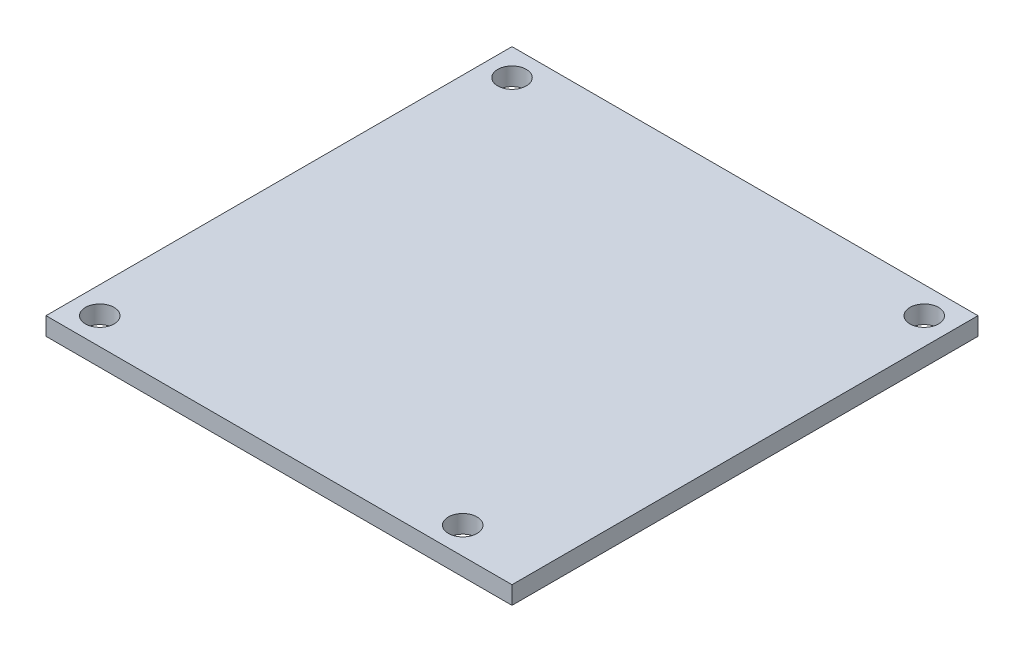
ISO-10303-21;
HEADER;
FILE_DESCRIPTION(('STEP AP214'),'2;1');
FILE_NAME('part.step','',(''),(''),'','','');
FILE_SCHEMA(('AUTOMOTIVE_DESIGN { 1 0 10303 214 1 1 1 1 }'));
ENDSEC;
DATA;
#1=APPLICATION_CONTEXT('core data for automotive mechanical design processes');
#2=APPLICATION_PROTOCOL_DEFINITION('international standard','automotive_design',2000,#1);
#3=PRODUCT_CONTEXT('',#1,'mechanical');
#4=PRODUCT('Part','Part','',(#3));
#5=PRODUCT_RELATED_PRODUCT_CATEGORY('part','',(#4));
#6=PRODUCT_DEFINITION_FORMATION('','',#4);
#7=PRODUCT_DEFINITION_CONTEXT('part definition',#1,'design');
#8=PRODUCT_DEFINITION('design','',#6,#7);
#9=PRODUCT_DEFINITION_SHAPE('','',#8);
#10=(LENGTH_UNIT() NAMED_UNIT(*) SI_UNIT(.MILLI.,.METRE.));
#11=(NAMED_UNIT(*) PLANE_ANGLE_UNIT() SI_UNIT($,.RADIAN.));
#12=(NAMED_UNIT(*) SI_UNIT($,.STERADIAN.) SOLID_ANGLE_UNIT());
#13=UNCERTAINTY_MEASURE_WITH_UNIT(LENGTH_MEASURE(1.E-05),#10,'distance_accuracy_value','');
#14=(GEOMETRIC_REPRESENTATION_CONTEXT(3) GLOBAL_UNCERTAINTY_ASSIGNED_CONTEXT((#13)) GLOBAL_UNIT_ASSIGNED_CONTEXT((#10,
#11,#12)) REPRESENTATION_CONTEXT('',''));
#15=CARTESIAN_POINT('',(0.,0.,0.));
#16=DIRECTION('',(0.,0.,1.));
#17=DIRECTION('',(1.,0.,0.));
#18=AXIS2_PLACEMENT_3D('',#15,#16,#17);
#19=CARTESIAN_POINT('',(26.,2.,-26.));
#20=DIRECTION('',(-1.,0.,0.));
#21=DIRECTION('',(0.,0.,1.));
#22=AXIS2_PLACEMENT_3D('',#19,#20,#21);
#23=PLANE('',#22);
#24=DIRECTION('',(0.,0.,-1.));
#25=VECTOR('',#24,1.);
#26=CARTESIAN_POINT('',(26.,0.,-26.));
#27=LINE('',#26,#25);
#28=CARTESIAN_POINT('',(26.,0.,26.));
#29=VERTEX_POINT('',#28);
#30=CARTESIAN_POINT('',(26.,0.,-26.));
#31=VERTEX_POINT('',#30);
#32=EDGE_CURVE('E98',#29,#31,#27,.T.);
#33=ORIENTED_EDGE('',*,*,#32,.T.);
#34=DIRECTION('',(0.,-1.,0.));
#35=VECTOR('',#34,1.);
#36=CARTESIAN_POINT('',(26.,2.,-26.));
#37=LINE('',#36,#35);
#38=CARTESIAN_POINT('',(26.,2.,-26.));
#39=VERTEX_POINT('',#38);
#40=EDGE_CURVE('E11',#39,#31,#37,.T.);
#41=ORIENTED_EDGE('',*,*,#40,.F.);
#42=DIRECTION('',(0.,0.,-1.));
#43=VECTOR('',#42,1.);
#44=CARTESIAN_POINT('',(26.,2.,-26.));
#45=LINE('',#44,#43);
#46=CARTESIAN_POINT('',(26.,2.,26.));
#47=VERTEX_POINT('',#46);
#48=EDGE_CURVE('E86',#47,#39,#45,.T.);
#49=ORIENTED_EDGE('',*,*,#48,.F.);
#50=DIRECTION('',(0.,-1.,0.));
#51=VECTOR('',#50,1.);
#52=CARTESIAN_POINT('',(26.,2.,26.));
#53=LINE('',#52,#51);
#54=EDGE_CURVE('E94',#47,#29,#53,.T.);
#55=ORIENTED_EDGE('',*,*,#54,.T.);
#56=EDGE_LOOP('',(#33,#41,#49,#55));
#57=FACE_BOUND('',#56,.T.);
#58=ADVANCED_FACE('F35',(#57),#23,.F.);
#59=CARTESIAN_POINT('',(-26.,2.,-26.));
#60=DIRECTION('',(0.,0.,1.));
#61=DIRECTION('',(1.,0.,0.));
#62=AXIS2_PLACEMENT_3D('',#59,#60,#61);
#63=PLANE('',#62);
#64=DIRECTION('',(-1.,0.,0.));
#65=VECTOR('',#64,1.);
#66=CARTESIAN_POINT('',(-26.,0.,-26.));
#67=LINE('',#66,#65);
#68=CARTESIAN_POINT('',(-26.,0.,-26.));
#69=VERTEX_POINT('',#68);
#70=EDGE_CURVE('E90',#31,#69,#67,.T.);
#71=ORIENTED_EDGE('',*,*,#70,.T.);
#72=DIRECTION('',(0.,-1.,0.));
#73=VECTOR('',#72,1.);
#74=CARTESIAN_POINT('',(-26.,2.,-26.));
#75=LINE('',#74,#73);
#76=CARTESIAN_POINT('',(-26.,2.,-26.));
#77=VERTEX_POINT('',#76);
#78=EDGE_CURVE('E43',#77,#69,#75,.T.);
#79=ORIENTED_EDGE('',*,*,#78,.F.);
#80=DIRECTION('',(-1.,0.,0.));
#81=VECTOR('',#80,1.);
#82=CARTESIAN_POINT('',(-26.,2.,-26.));
#83=LINE('',#82,#81);
#84=EDGE_CURVE('E81',#39,#77,#83,.T.);
#85=ORIENTED_EDGE('',*,*,#84,.F.);
#86=ORIENTED_EDGE('',*,*,#40,.T.);
#87=EDGE_LOOP('',(#71,#79,#85,#86));
#88=FACE_BOUND('',#87,.T.);
#89=ADVANCED_FACE('F89',(#88),#63,.F.);
#90=CARTESIAN_POINT('',(-26.,2.,-26.));
#91=DIRECTION('',(1.,0.,0.));
#92=DIRECTION('',(0.,0.,-1.));
#93=AXIS2_PLACEMENT_3D('',#90,#91,#92);
#94=PLANE('',#93);
#95=DIRECTION('',(0.,0.,1.));
#96=VECTOR('',#95,1.);
#97=CARTESIAN_POINT('',(-26.,0.,-26.));
#98=LINE('',#97,#96);
#99=CARTESIAN_POINT('',(-26.,0.,26.));
#100=VERTEX_POINT('',#99);
#101=EDGE_CURVE('E68',#69,#100,#98,.T.);
#102=ORIENTED_EDGE('',*,*,#101,.T.);
#103=DIRECTION('',(0.,-1.,0.));
#104=VECTOR('',#103,1.);
#105=CARTESIAN_POINT('',(-26.,2.,26.));
#106=LINE('',#105,#104);
#107=CARTESIAN_POINT('',(-26.,2.,26.));
#108=VERTEX_POINT('',#107);
#109=EDGE_CURVE('E91',#108,#100,#106,.T.);
#110=ORIENTED_EDGE('',*,*,#109,.F.);
#111=DIRECTION('',(0.,0.,1.));
#112=VECTOR('',#111,1.);
#113=CARTESIAN_POINT('',(-26.,2.,-26.));
#114=LINE('',#113,#112);
#115=EDGE_CURVE('E84',#77,#108,#114,.T.);
#116=ORIENTED_EDGE('',*,*,#115,.F.);
#117=ORIENTED_EDGE('',*,*,#78,.T.);
#118=EDGE_LOOP('',(#102,#110,#116,#117));
#119=FACE_BOUND('',#118,.T.);
#120=ADVANCED_FACE('F92',(#119),#94,.F.);
#121=CARTESIAN_POINT('',(-26.,2.,26.));
#122=DIRECTION('',(0.,0.,-1.));
#123=DIRECTION('',(-1.,0.,0.));
#124=AXIS2_PLACEMENT_3D('',#121,#122,#123);
#125=PLANE('',#124);
#126=DIRECTION('',(1.,0.,0.));
#127=VECTOR('',#126,1.);
#128=CARTESIAN_POINT('',(-26.,0.,26.));
#129=LINE('',#128,#127);
#130=EDGE_CURVE('E74',#100,#29,#129,.T.);
#131=ORIENTED_EDGE('',*,*,#130,.T.);
#132=ORIENTED_EDGE('',*,*,#54,.F.);
#133=DIRECTION('',(1.,0.,0.));
#134=VECTOR('',#133,1.);
#135=CARTESIAN_POINT('',(-26.,2.,26.));
#136=LINE('',#135,#134);
#137=EDGE_CURVE('E51',#108,#47,#136,.T.);
#138=ORIENTED_EDGE('',*,*,#137,.F.);
#139=ORIENTED_EDGE('',*,*,#109,.T.);
#140=EDGE_LOOP('',(#131,#132,#138,#139));
#141=FACE_BOUND('',#140,.T.);
#142=ADVANCED_FACE('F106',(#141),#125,.F.);
#143=CARTESIAN_POINT('',(26.,2.,26.));
#144=DIRECTION('',(0.,1.,0.));
#145=DIRECTION('',(0.,0.,1.));
#146=AXIS2_PLACEMENT_3D('',#143,#144,#145);
#147=PLANE('',#146);
#148=CARTESIAN_POINT('',(17.5,2.,23.));
#149=DIRECTION('',(0.,1.,0.));
#150=DIRECTION('',(0.,0.,1.));
#151=AXIS2_PLACEMENT_3D('',#148,#149,#150);
#152=CIRCLE('',#151,1.6);
#153=CARTESIAN_POINT('',(17.5,2.,24.6));
#154=VERTEX_POINT('',#153);
#155=EDGE_CURVE('E130',#154,#154,#152,.T.);
#156=ORIENTED_EDGE('',*,*,#155,.F.);
#157=EDGE_LOOP('',(#156));
#158=FACE_BOUND('',#157,.T.);
#159=CARTESIAN_POINT('',(-23.,2.,23.));
#160=DIRECTION('',(0.,1.,0.));
#161=DIRECTION('',(0.,0.,1.));
#162=AXIS2_PLACEMENT_3D('',#159,#160,#161);
#163=CIRCLE('',#162,1.6);
#164=CARTESIAN_POINT('',(-23.,2.,24.6));
#165=VERTEX_POINT('',#164);
#166=EDGE_CURVE('E124',#165,#165,#163,.T.);
#167=ORIENTED_EDGE('',*,*,#166,.F.);
#168=EDGE_LOOP('',(#167));
#169=FACE_BOUND('',#168,.T.);
#170=CARTESIAN_POINT('',(-23.,2.,-23.));
#171=DIRECTION('',(0.,1.,0.));
#172=DIRECTION('',(0.,0.,1.));
#173=AXIS2_PLACEMENT_3D('',#170,#171,#172);
#174=CIRCLE('',#173,1.6);
#175=CARTESIAN_POINT('',(-23.,2.,-21.4));
#176=VERTEX_POINT('',#175);
#177=EDGE_CURVE('E118',#176,#176,#174,.T.);
#178=ORIENTED_EDGE('',*,*,#177,.F.);
#179=EDGE_LOOP('',(#178));
#180=FACE_BOUND('',#179,.T.);
#181=CARTESIAN_POINT('',(23.,2.,-23.));
#182=DIRECTION('',(0.,1.,0.));
#183=DIRECTION('',(0.,0.,1.));
#184=AXIS2_PLACEMENT_3D('',#181,#182,#183);
#185=CIRCLE('',#184,1.6);
#186=CARTESIAN_POINT('',(23.,2.,-21.4));
#187=VERTEX_POINT('',#186);
#188=EDGE_CURVE('E112',#187,#187,#185,.T.);
#189=ORIENTED_EDGE('',*,*,#188,.F.);
#190=EDGE_LOOP('',(#189));
#191=FACE_BOUND('',#190,.T.);
#192=ORIENTED_EDGE('',*,*,#48,.T.);
#193=ORIENTED_EDGE('',*,*,#84,.T.);
#194=ORIENTED_EDGE('',*,*,#115,.T.);
#195=ORIENTED_EDGE('',*,*,#137,.T.);
#196=EDGE_LOOP('',(#192,#193,#194,#195));
#197=FACE_BOUND('',#196,.T.);
#198=ADVANCED_FACE('F82',(#158,#169,#180,#191,#197),#147,.T.);
#199=CARTESIAN_POINT('',(26.,0.,26.));
#200=DIRECTION('',(0.,1.,0.));
#201=DIRECTION('',(0.,0.,1.));
#202=AXIS2_PLACEMENT_3D('',#199,#200,#201);
#203=PLANE('',#202);
#204=CARTESIAN_POINT('',(17.5,0.,23.));
#205=DIRECTION('',(0.,1.,0.));
#206=DIRECTION('',(0.,0.,1.));
#207=AXIS2_PLACEMENT_3D('',#204,#205,#206);
#208=CIRCLE('',#207,1.6);
#209=CARTESIAN_POINT('',(17.5,0.,24.6));
#210=VERTEX_POINT('',#209);
#211=EDGE_CURVE('E127',#210,#210,#208,.T.);
#212=ORIENTED_EDGE('',*,*,#211,.T.);
#213=EDGE_LOOP('',(#212));
#214=FACE_BOUND('',#213,.T.);
#215=CARTESIAN_POINT('',(-23.,0.,23.));
#216=DIRECTION('',(0.,1.,0.));
#217=DIRECTION('',(0.,0.,1.));
#218=AXIS2_PLACEMENT_3D('',#215,#216,#217);
#219=CIRCLE('',#218,1.6);
#220=CARTESIAN_POINT('',(-23.,0.,24.6));
#221=VERTEX_POINT('',#220);
#222=EDGE_CURVE('E121',#221,#221,#219,.T.);
#223=ORIENTED_EDGE('',*,*,#222,.T.);
#224=EDGE_LOOP('',(#223));
#225=FACE_BOUND('',#224,.T.);
#226=CARTESIAN_POINT('',(-23.,0.,-23.));
#227=DIRECTION('',(0.,1.,0.));
#228=DIRECTION('',(0.,0.,1.));
#229=AXIS2_PLACEMENT_3D('',#226,#227,#228);
#230=CIRCLE('',#229,1.6);
#231=CARTESIAN_POINT('',(-23.,0.,-21.4));
#232=VERTEX_POINT('',#231);
#233=EDGE_CURVE('E115',#232,#232,#230,.T.);
#234=ORIENTED_EDGE('',*,*,#233,.T.);
#235=EDGE_LOOP('',(#234));
#236=FACE_BOUND('',#235,.T.);
#237=CARTESIAN_POINT('',(23.,0.,-23.));
#238=DIRECTION('',(0.,1.,0.));
#239=DIRECTION('',(0.,0.,1.));
#240=AXIS2_PLACEMENT_3D('',#237,#238,#239);
#241=CIRCLE('',#240,1.6);
#242=CARTESIAN_POINT('',(23.,0.,-21.4));
#243=VERTEX_POINT('',#242);
#244=EDGE_CURVE('E101',#243,#243,#241,.T.);
#245=ORIENTED_EDGE('',*,*,#244,.T.);
#246=EDGE_LOOP('',(#245));
#247=FACE_BOUND('',#246,.T.);
#248=ORIENTED_EDGE('',*,*,#32,.F.);
#249=ORIENTED_EDGE('',*,*,#130,.F.);
#250=ORIENTED_EDGE('',*,*,#101,.F.);
#251=ORIENTED_EDGE('',*,*,#70,.F.);
#252=EDGE_LOOP('',(#248,#249,#250,#251));
#253=FACE_BOUND('',#252,.T.);
#254=ADVANCED_FACE('F109',(#214,#225,#236,#247,#253),#203,.F.);
#255=CARTESIAN_POINT('',(23.,0.,-23.));
#256=DIRECTION('',(0.,1.,0.));
#257=DIRECTION('',(0.,0.,1.));
#258=AXIS2_PLACEMENT_3D('',#255,#256,#257);
#259=CYLINDRICAL_SURFACE('',#258,1.6);
#260=ORIENTED_EDGE('',*,*,#244,.F.);
#261=EDGE_LOOP('',(#260));
#262=FACE_BOUND('',#261,.T.);
#263=ORIENTED_EDGE('',*,*,#188,.T.);
#264=EDGE_LOOP('',(#263));
#265=FACE_BOUND('',#264,.T.);
#266=ADVANCED_FACE('F154',(#262,#265),#259,.F.);
#267=CARTESIAN_POINT('',(-23.,0.,-23.));
#268=DIRECTION('',(0.,1.,0.));
#269=DIRECTION('',(0.,0.,1.));
#270=AXIS2_PLACEMENT_3D('',#267,#268,#269);
#271=CYLINDRICAL_SURFACE('',#270,1.6);
#272=ORIENTED_EDGE('',*,*,#233,.F.);
#273=EDGE_LOOP('',(#272));
#274=FACE_BOUND('',#273,.T.);
#275=ORIENTED_EDGE('',*,*,#177,.T.);
#276=EDGE_LOOP('',(#275));
#277=FACE_BOUND('',#276,.T.);
#278=ADVANCED_FACE('F156',(#274,#277),#271,.F.);
#279=CARTESIAN_POINT('',(-23.,0.,23.));
#280=DIRECTION('',(0.,1.,0.));
#281=DIRECTION('',(0.,0.,1.));
#282=AXIS2_PLACEMENT_3D('',#279,#280,#281);
#283=CYLINDRICAL_SURFACE('',#282,1.6);
#284=ORIENTED_EDGE('',*,*,#222,.F.);
#285=EDGE_LOOP('',(#284));
#286=FACE_BOUND('',#285,.T.);
#287=ORIENTED_EDGE('',*,*,#166,.T.);
#288=EDGE_LOOP('',(#287));
#289=FACE_BOUND('',#288,.T.);
#290=ADVANCED_FACE('F141',(#286,#289),#283,.F.);
#291=CARTESIAN_POINT('',(17.5,0.,23.));
#292=DIRECTION('',(0.,1.,0.));
#293=DIRECTION('',(0.,0.,1.));
#294=AXIS2_PLACEMENT_3D('',#291,#292,#293);
#295=CYLINDRICAL_SURFACE('',#294,1.6);
#296=ORIENTED_EDGE('',*,*,#211,.F.);
#297=EDGE_LOOP('',(#296));
#298=FACE_BOUND('',#297,.T.);
#299=ORIENTED_EDGE('',*,*,#155,.T.);
#300=EDGE_LOOP('',(#299));
#301=FACE_BOUND('',#300,.T.);
#302=ADVANCED_FACE('F138',(#298,#301),#295,.F.);
#303=CLOSED_SHELL('',(#58,#89,#120,#142,#198,#254,#266,#278,#290,#302));
#304=MANIFOLD_SOLID_BREP('B2',#303);
#305=ADVANCED_BREP_SHAPE_REPRESENTATION('',(#18,#304),#14);
#306=SHAPE_DEFINITION_REPRESENTATION(#9,#305);
ENDSEC;
END-ISO-10303-21;
